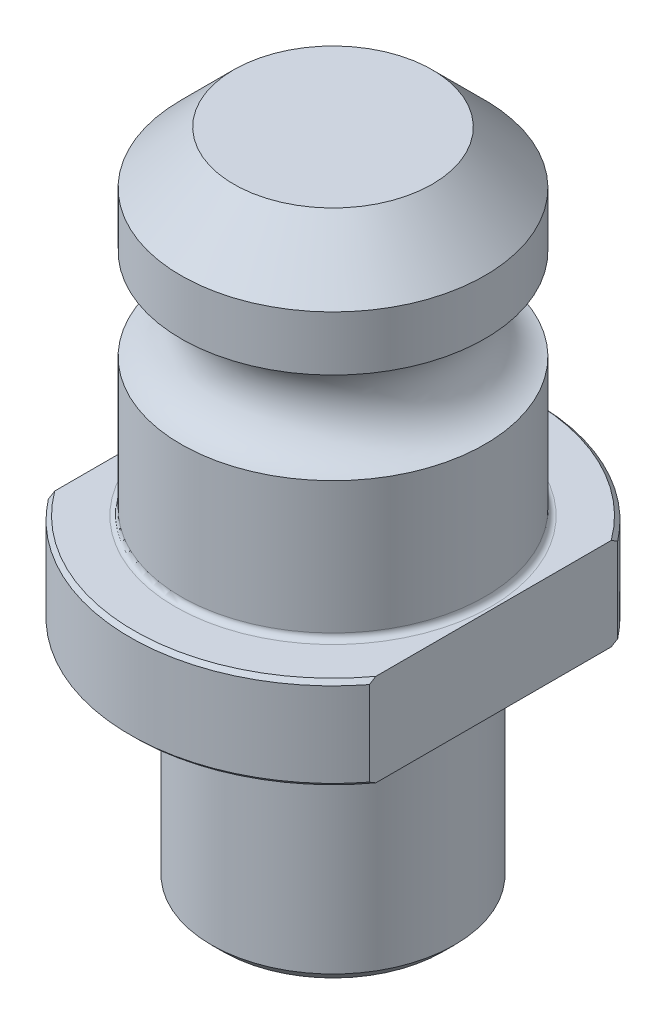
ISO-10303-21;
HEADER;
FILE_DESCRIPTION(('STEP AP214'),'2;1');
FILE_NAME('part.step','',(''),(''),'','','');
FILE_SCHEMA(('AUTOMOTIVE_DESIGN { 1 0 10303 214 1 1 1 1 }'));
ENDSEC;
DATA;
#1=APPLICATION_CONTEXT('core data for automotive mechanical design processes');
#2=APPLICATION_PROTOCOL_DEFINITION('international standard','automotive_design',2000,#1);
#3=PRODUCT_CONTEXT('',#1,'mechanical');
#4=PRODUCT('Part','Part','',(#3));
#5=PRODUCT_RELATED_PRODUCT_CATEGORY('part','',(#4));
#6=PRODUCT_DEFINITION_FORMATION('','',#4);
#7=PRODUCT_DEFINITION_CONTEXT('part definition',#1,'design');
#8=PRODUCT_DEFINITION('design','',#6,#7);
#9=PRODUCT_DEFINITION_SHAPE('','',#8);
#10=(LENGTH_UNIT() NAMED_UNIT(*) SI_UNIT(.MILLI.,.METRE.));
#11=(NAMED_UNIT(*) PLANE_ANGLE_UNIT() SI_UNIT($,.RADIAN.));
#12=(NAMED_UNIT(*) SI_UNIT($,.STERADIAN.) SOLID_ANGLE_UNIT());
#13=UNCERTAINTY_MEASURE_WITH_UNIT(LENGTH_MEASURE(1.E-05),#10,'distance_accuracy_value','');
#14=(GEOMETRIC_REPRESENTATION_CONTEXT(3) GLOBAL_UNCERTAINTY_ASSIGNED_CONTEXT((#13)) GLOBAL_UNIT_ASSIGNED_CONTEXT((#10,
#11,#12)) REPRESENTATION_CONTEXT('',''));
#15=CARTESIAN_POINT('',(0.,0.,0.));
#16=DIRECTION('',(0.,0.,1.));
#17=DIRECTION('',(1.,0.,0.));
#18=AXIS2_PLACEMENT_3D('',#15,#16,#17);
#19=CARTESIAN_POINT('',(0.,-30.0736,0.));
#20=DIRECTION('',(0.,1.,0.));
#21=DIRECTION('',(-1.,0.,0.));
#22=AXIS2_PLACEMENT_3D('',#19,#20,#21);
#23=CYLINDRICAL_SURFACE('',#22,26.4922);
#24=DIRECTION('',(0.,1.,0.));
#25=VECTOR('',#24,1.);
#26=CARTESIAN_POINT('',(-20.955,-30.0736,-16.2087826760679));
#27=LINE('',#26,#25);
#28=CARTESIAN_POINT('',(-20.955,0.507999999999984,-16.2087826760679));
#29=VERTEX_POINT('',#28);
#30=CARTESIAN_POINT('',(-20.955,11.5316,-16.2087826760679));
#31=VERTEX_POINT('',#30);
#32=EDGE_CURVE('E178',#29,#31,#27,.T.);
#33=ORIENTED_EDGE('',*,*,#32,.T.);
#34=CARTESIAN_POINT('',(0.,11.5316,0.));
#35=DIRECTION('',(0.,1.,0.));
#36=DIRECTION('',(-1.,0.,0.));
#37=AXIS2_PLACEMENT_3D('',#34,#35,#36);
#38=CIRCLE('',#37,26.4922);
#39=CARTESIAN_POINT('',(20.955,11.5316,-16.2087826760679));
#40=VERTEX_POINT('',#39);
#41=EDGE_CURVE('E196',#31,#40,#38,.F.);
#42=ORIENTED_EDGE('',*,*,#41,.T.);
#43=DIRECTION('',(0.,1.,0.));
#44=VECTOR('',#43,1.);
#45=CARTESIAN_POINT('',(20.955,-30.0736,-16.2087826760679));
#46=LINE('',#45,#44);
#47=CARTESIAN_POINT('',(20.955,0.507999999999986,-16.2087826760679));
#48=VERTEX_POINT('',#47);
#49=EDGE_CURVE('E158',#48,#40,#46,.T.);
#50=ORIENTED_EDGE('',*,*,#49,.F.);
#51=CARTESIAN_POINT('',(0.,0.507999999999984,0.));
#52=DIRECTION('',(0.,-1.,0.));
#53=DIRECTION('',(1.,0.,0.));
#54=AXIS2_PLACEMENT_3D('',#51,#52,#53);
#55=CIRCLE('',#54,26.4922);
#56=EDGE_CURVE('E199',#48,#29,#55,.F.);
#57=ORIENTED_EDGE('',*,*,#56,.T.);
#58=EDGE_LOOP('',(#33,#42,#50,#57));
#59=FACE_BOUND('',#58,.T.);
#60=ADVANCED_FACE('F31',(#59),#23,.T.);
#61=CARTESIAN_POINT('',(0.,0.507999999999984,0.));
#62=DIRECTION('',(0.,1.,0.));
#63=DIRECTION('',(-1.,0.,0.));
#64=AXIS2_PLACEMENT_3D('',#61,#62,#63);
#65=CONICAL_SURFACE('',#64,26.4922,0.785398163397452);
#66=CARTESIAN_POINT('',(-20.955,15.3786316810791,-35.6619099275024));
#67=CARTESIAN_POINT('',(-20.955,14.9216793764967,-35.1318867491076));
#68=CARTESIAN_POINT('',(-20.955,14.4662030686278,-34.6005861469611));
#69=CARTESIAN_POINT('',(-20.955,13.5586344415844,-33.5350869427466));
#70=CARTESIAN_POINT('',(-20.955,13.1065421827849,-33.000888289266));
#71=CARTESIAN_POINT('',(-20.955,12.205968591938,-31.9290052120931));
#72=CARTESIAN_POINT('',(-20.955,11.7574891447149,-31.3913192035786));
#73=CARTESIAN_POINT('',(-20.955,10.8649120638348,-30.312323516559));
#74=CARTESIAN_POINT('',(-20.955,10.4208144137888,-29.7710138516202));
#75=CARTESIAN_POINT('',(-20.955,9.52668821952122,-28.6708291561023));
#76=CARTESIAN_POINT('',(-20.955,9.07678583859596,-28.1118514959616));
#77=CARTESIAN_POINT('',(-20.955,8.18309722765685,-26.989029407178));
#78=CARTESIAN_POINT('',(-20.955,7.73931095538071,-26.425185012208));
#79=CARTESIAN_POINT('',(-20.955,6.85897582814535,-25.2920818271233));
#80=CARTESIAN_POINT('',(-20.955,6.42242528048358,-24.7228243538003));
#81=CARTESIAN_POINT('',(-20.955,5.55770659738342,-23.5779689040285));
#82=CARTESIAN_POINT('',(-20.955,5.12953845536948,-23.002370932554));
#83=CARTESIAN_POINT('',(-20.955,4.28247126091997,-21.842992233023));
#84=CARTESIAN_POINT('',(-20.955,3.86358783515081,-21.2592000655374));
#85=CARTESIAN_POINT('',(-20.955,3.03773164306435,-20.083220901885));
#86=CARTESIAN_POINT('',(-20.955,2.63075901321588,-19.4910338096481));
#87=CARTESIAN_POINT('',(-20.955,1.83083466168243,-18.2964784979267));
#88=CARTESIAN_POINT('',(-20.955,1.43789562453277,-17.6941017584344));
#89=CARTESIAN_POINT('',(-20.955,0.669551593220243,-16.4782430882497));
#90=CARTESIAN_POINT('',(-20.955,0.294146217763032,-15.8647613994531));
#91=CARTESIAN_POINT('',(-20.955,-0.432002865836843,-14.630437277539));
#92=CARTESIAN_POINT('',(-20.955,-0.782931639839121,-14.0097042501795));
#93=CARTESIAN_POINT('',(-20.955,-1.45875294781339,-12.7540422315145));
#94=CARTESIAN_POINT('',(-20.955,-1.78364236607461,-12.119111552995));
#95=CARTESIAN_POINT('',(-20.955,-2.40065204497457,-10.8345950751049));
#96=CARTESIAN_POINT('',(-20.955,-2.69282213181895,-10.1850334195645));
#97=CARTESIAN_POINT('',(-20.955,-3.23726727986781,-8.86957079794427));
#98=CARTESIAN_POINT('',(-20.955,-3.48955812101578,-8.20367641570651));
#99=CARTESIAN_POINT('',(-20.955,-3.95119671298151,-6.83837448786304));
#100=CARTESIAN_POINT('',(-20.955,-4.15932452663909,-6.13854536942428));
#101=CARTESIAN_POINT('',(-20.955,-4.42557667150594,-5.0773677597743));
#102=CARTESIAN_POINT('',(-20.955,-4.50667587473933,-4.72170462236656));
#103=CARTESIAN_POINT('',(-20.955,-4.65239096179193,-4.00703560322836));
#104=CARTESIAN_POINT('',(-20.955,-4.71700914684199,-3.64803019544004));
#105=CARTESIAN_POINT('',(-20.955,-4.82842178039746,-2.92921911832924));
#106=CARTESIAN_POINT('',(-20.955,-4.87530955594894,-2.56942795720181));
#107=CARTESIAN_POINT('',(-20.955,-4.95093580213762,-1.84793526800252));
#108=CARTESIAN_POINT('',(-20.955,-4.97967443767978,-1.4862337573184));
#109=CARTESIAN_POINT('',(-20.955,-5.01847483744489,-0.761842291258823));
#110=CARTESIAN_POINT('',(-20.955,-5.02853747477161,-0.399152382884933));
#111=CARTESIAN_POINT('',(-20.955,-5.02979913742401,0.326260889713069));
#112=CARTESIAN_POINT('',(-20.955,-5.02099813763078,0.688984253981089));
#113=CARTESIAN_POINT('',(-20.955,-4.98470198526908,1.41341460895418));
#114=CARTESIAN_POINT('',(-20.955,-4.95721069837262,1.77512179430263));
#115=CARTESIAN_POINT('',(-20.955,-4.8840435620658,2.49668205915928));
#116=CARTESIAN_POINT('',(-20.955,-4.83836765499246,2.85653513278446));
#117=CARTESIAN_POINT('',(-20.955,-4.72962027558933,3.57361600608002));
#118=CARTESIAN_POINT('',(-20.955,-4.66654788547041,3.93084366621991));
#119=CARTESIAN_POINT('',(-20.955,-4.52402701562188,4.64203334338745));
#120=CARTESIAN_POINT('',(-20.955,-4.44457605407092,4.99599485699835));
#121=CARTESIAN_POINT('',(-20.955,-4.18224544344754,6.05675532692679));
#122=CARTESIAN_POINT('',(-20.955,-3.97609658034429,6.75791934744646));
#123=CARTESIAN_POINT('',(-20.955,-3.62827640165839,7.79627618391861));
#124=CARTESIAN_POINT('',(-20.955,-3.50589488562347,8.14018416623479));
#125=CARTESIAN_POINT('',(-20.955,-3.24945534638195,8.82365293862814));
#126=CARTESIAN_POINT('',(-20.955,-3.11539705650793,9.16321362922113));
#127=CARTESIAN_POINT('',(-20.955,-2.79928394879735,9.92876903399494));
#128=CARTESIAN_POINT('',(-20.955,-2.61402065033465,10.3534355980843));
#129=CARTESIAN_POINT('',(-20.955,-2.22872511055782,11.1960235010303));
#130=CARTESIAN_POINT('',(-20.955,-2.02869178517524,11.6139443420257));
#131=CARTESIAN_POINT('',(-20.955,-1.61566843118649,12.4435850656605));
#132=CARTESIAN_POINT('',(-20.955,-1.40267173067073,12.8553016167744));
#133=CARTESIAN_POINT('',(-20.955,-0.965488560966872,13.6727152546063));
#134=CARTESIAN_POINT('',(-20.955,-0.741302473239506,14.0784125459179));
#135=CARTESIAN_POINT('',(-20.955,-0.28269064512495,14.8850902307436));
#136=CARTESIAN_POINT('',(-20.955,-0.0482444524277921,15.2860589726437));
#137=CARTESIAN_POINT('',(-20.955,0.429222390556218,16.082863076133));
#138=CARTESIAN_POINT('',(-20.955,0.672243339674915,16.478698258158));
#139=CARTESIAN_POINT('',(-20.955,1.41240613564717,17.6589447676084));
#140=CARTESIAN_POINT('',(-20.955,1.92077842067232,18.4363238664039));
#141=CARTESIAN_POINT('',(-20.955,2.96328687809537,19.9792291602264));
#142=CARTESIAN_POINT('',(-20.955,3.49754043758378,20.7446754395278));
#143=CARTESIAN_POINT('',(-20.955,4.58448890471796,22.2623700786226));
#144=CARTESIAN_POINT('',(-20.955,5.13718455391019,23.0146179058533));
#145=CARTESIAN_POINT('',(-20.955,6.25663004461089,24.5071890832017));
#146=CARTESIAN_POINT('',(-20.955,6.82336288867572,25.2475252208699));
#147=CARTESIAN_POINT('',(-20.955,7.96869622565411,26.718913960253));
#148=CARTESIAN_POINT('',(-20.955,8.54729643992717,27.449966779285));
#149=CARTESIAN_POINT('',(-20.955,9.64159884476376,28.8137066048225));
#150=CARTESIAN_POINT('',(-20.955,10.1561632277905,29.4473084849898));
#151=CARTESIAN_POINT('',(-20.955,11.1917248024465,30.7094034474824));
#152=CARTESIAN_POINT('',(-20.955,11.7127230358346,31.3378956743989));
#153=CARTESIAN_POINT('',(-20.955,12.7553253783335,32.5845773164151));
#154=CARTESIAN_POINT('',(-20.955,13.2768798144798,33.2028083216013));
#155=CARTESIAN_POINT('',(-20.955,14.3245141746313,34.4352284310873));
#156=CARTESIAN_POINT('',(-20.955,14.8505932435754,35.0494182619761));
#157=CARTESIAN_POINT('',(-20.955,15.3786316810791,35.6619099275024));
#158=B_SPLINE_CURVE_WITH_KNOTS('',3,(#66,#67,#68,#69,#70,#71,#72,#73,#74,#75,#76,#77,#78,#79,
#80,#81,#82,#83,#84,#85,#86,#87,#88,#89,#90,#91,#92,#93,#94,#95,#96,#97,#98,#99,#100,#101,#102,
#103,#104,#105,#106,#107,#108,#109,#110,#111,#112,#113,#114,#115,#116,#117,#118,#119,#120,#121,
#122,#123,#124,#125,#126,#127,#128,#129,#130,#131,#132,#133,#134,#135,#136,#137,#138,#139,#140,
#141,#142,#143,#144,#145,#146,#147,#148,#149,#150,#151,#152,#153,#154,#155,#156,#157),
.UNSPECIFIED.,.F.,.F.,(4,2,2,2,2,2,2,2,2,2,2,2,2,2,2,2,2,2,2,2,2,2,2,2,2,2,2,2,2,2,2,2,2,2,2,2,
2,2,2,2,2,2,2,2,2,4),(0.,2.09942410165156,4.19888557039205,6.29937935967337,8.39986528957602,
10.552457837884,12.7050355043173,14.8571022863838,17.0091673801996,19.1646150287776,
21.3200873638983,23.4774610450651,25.6347877892161,27.7734736972529,29.9124151265691,
32.0480536840951,34.1828450571805,36.3705707704272,37.4646250503705,38.5585264846929,
39.6465870651191,40.7346377591721,41.8226375855233,42.9106388606607,43.9984151752578,
45.0861949391944,46.1740321022885,47.2620342251061,49.4516892833064,50.5466504012234,
51.6416365317908,53.0312643633345,54.4209942902935,55.8114456246282,57.2018495890064,
58.5951640870748,59.9885271904642,62.7744689635165,65.5745127339502,68.3746692286286,
71.1715865124565,73.9684382009378,76.4170762202526,78.8661160578072,81.2926243402521,
83.7186837210244),.UNSPECIFIED.);
#159=CARTESIAN_POINT('',(-20.955,0.,-15.364459790048));
#160=VERTEX_POINT('',#159);
#161=EDGE_CURVE('E179',#29,#160,#158,.T.);
#162=ORIENTED_EDGE('',*,*,#161,.F.);
#163=ORIENTED_EDGE('',*,*,#56,.F.);
#164=CARTESIAN_POINT('',(20.955,15.3786316810791,35.6619099275024));
#165=CARTESIAN_POINT('',(20.955,14.9216793764967,35.1318867491076));
#166=CARTESIAN_POINT('',(20.955,14.4662030686279,34.6005861469611));
#167=CARTESIAN_POINT('',(20.955,13.5586344415845,33.5350869427466));
#168=CARTESIAN_POINT('',(20.955,13.1065421827849,33.000888289266));
#169=CARTESIAN_POINT('',(20.955,12.205968591938,31.9290052120931));
#170=CARTESIAN_POINT('',(20.955,11.7574891447149,31.3913192035786));
#171=CARTESIAN_POINT('',(20.955,10.8649120638348,30.312323516559));
#172=CARTESIAN_POINT('',(20.955,10.4208144137888,29.7710138516202));
#173=CARTESIAN_POINT('',(20.955,9.52668821952123,28.6708291561023));
#174=CARTESIAN_POINT('',(20.955,9.07678583859597,28.1118514959616));
#175=CARTESIAN_POINT('',(20.955,8.18309722765686,26.989029407178));
#176=CARTESIAN_POINT('',(20.955,7.73931095538071,26.425185012208));
#177=CARTESIAN_POINT('',(20.955,6.85897582814535,25.2920818271233));
#178=CARTESIAN_POINT('',(20.955,6.42242528048358,24.7228243538003));
#179=CARTESIAN_POINT('',(20.955,5.55770659738343,23.5779689040285));
#180=CARTESIAN_POINT('',(20.955,5.12953845536949,23.002370932554));
#181=CARTESIAN_POINT('',(20.955,4.28247126091998,21.842992233023));
#182=CARTESIAN_POINT('',(20.955,3.86358783515082,21.2592000655374));
#183=CARTESIAN_POINT('',(20.955,3.03773164306436,20.0832209018851));
#184=CARTESIAN_POINT('',(20.955,2.63075901321589,19.4910338096481));
#185=CARTESIAN_POINT('',(20.955,1.83083466168244,18.2964784979267));
#186=CARTESIAN_POINT('',(20.955,1.43789562453277,17.6941017584344));
#187=CARTESIAN_POINT('',(20.955,0.669551593220245,16.4782430882497));
#188=CARTESIAN_POINT('',(20.955,0.294146217763037,15.8647613994531));
#189=CARTESIAN_POINT('',(20.955,-0.432002865836835,14.630437277539));
#190=CARTESIAN_POINT('',(20.955,-0.782931639839114,14.0097042501795));
#191=CARTESIAN_POINT('',(20.955,-1.45875294781339,12.7540422315145));
#192=CARTESIAN_POINT('',(20.955,-1.78364236607461,12.119111552995));
#193=CARTESIAN_POINT('',(20.955,-2.40065204497457,10.8345950751049));
#194=CARTESIAN_POINT('',(20.955,-2.69282213181894,10.1850334195645));
#195=CARTESIAN_POINT('',(20.955,-3.23726727986781,8.86957079794428));
#196=CARTESIAN_POINT('',(20.955,-3.48955812101578,8.20367641570652));
#197=CARTESIAN_POINT('',(20.955,-3.95119671298151,6.83837448786304));
#198=CARTESIAN_POINT('',(20.955,-4.15932452663908,6.13854536942429));
#199=CARTESIAN_POINT('',(20.955,-4.42557667150594,5.0773677597743));
#200=CARTESIAN_POINT('',(20.955,-4.50667587473933,4.72170462236656));
#201=CARTESIAN_POINT('',(20.955,-4.65239096179193,4.00703560322836));
#202=CARTESIAN_POINT('',(20.955,-4.71700914684199,3.64803019544004));
#203=CARTESIAN_POINT('',(20.955,-4.82842178039746,2.92921911832924));
#204=CARTESIAN_POINT('',(20.955,-4.87530955594894,2.56942795720182));
#205=CARTESIAN_POINT('',(20.955,-4.95093580213762,1.84793526800253));
#206=CARTESIAN_POINT('',(20.955,-4.97967443767978,1.4862337573184));
#207=CARTESIAN_POINT('',(20.955,-5.01847483744489,0.761842291258827));
#208=CARTESIAN_POINT('',(20.955,-5.02853747477162,0.399152382884936));
#209=CARTESIAN_POINT('',(20.955,-5.02979913742401,-0.326260889713066));
#210=CARTESIAN_POINT('',(20.955,-5.02099813763078,-0.688984253981084));
#211=CARTESIAN_POINT('',(20.955,-4.98470198526908,-1.41341460895417));
#212=CARTESIAN_POINT('',(20.955,-4.95721069837262,-1.77512179430262));
#213=CARTESIAN_POINT('',(20.955,-4.8840435620658,-2.49668205915927));
#214=CARTESIAN_POINT('',(20.955,-4.83836765499246,-2.85653513278446));
#215=CARTESIAN_POINT('',(20.955,-4.72962027558933,-3.57361600608002));
#216=CARTESIAN_POINT('',(20.955,-4.66654788547041,-3.93084366621991));
#217=CARTESIAN_POINT('',(20.955,-4.52402701562188,-4.64203334338745));
#218=CARTESIAN_POINT('',(20.955,-4.44457605407092,-4.99599485699834));
#219=CARTESIAN_POINT('',(20.955,-4.18224544344754,-6.05675532692679));
#220=CARTESIAN_POINT('',(20.955,-3.97609658034429,-6.75791934744645));
#221=CARTESIAN_POINT('',(20.955,-3.62827640165839,-7.7962761839186));
#222=CARTESIAN_POINT('',(20.955,-3.50589488562347,-8.14018416623478));
#223=CARTESIAN_POINT('',(20.955,-3.24945534638195,-8.82365293862813));
#224=CARTESIAN_POINT('',(20.955,-3.11539705650794,-9.16321362922112));
#225=CARTESIAN_POINT('',(20.955,-2.79928394879736,-9.92876903399493));
#226=CARTESIAN_POINT('',(20.955,-2.61402065033465,-10.3534355980843));
#227=CARTESIAN_POINT('',(20.955,-2.22872511055782,-11.1960235010303));
#228=CARTESIAN_POINT('',(20.955,-2.02869178517524,-11.6139443420257));
#229=CARTESIAN_POINT('',(20.955,-1.61566843118649,-12.4435850656605));
#230=CARTESIAN_POINT('',(20.955,-1.40267173067073,-12.8553016167744));
#231=CARTESIAN_POINT('',(20.955,-0.965488560966878,-13.6727152546063));
#232=CARTESIAN_POINT('',(20.955,-0.741302473239514,-14.0784125459179));
#233=CARTESIAN_POINT('',(20.955,-0.28269064512496,-14.8850902307436));
#234=CARTESIAN_POINT('',(20.955,-0.0482444524278021,-15.2860589726437));
#235=CARTESIAN_POINT('',(20.955,0.429222390556209,-16.082863076133));
#236=CARTESIAN_POINT('',(20.955,0.672243339674907,-16.478698258158));
#237=CARTESIAN_POINT('',(20.955,1.41240613564717,-17.6589447676083));
#238=CARTESIAN_POINT('',(20.955,1.92077842067231,-18.4363238664039));
#239=CARTESIAN_POINT('',(20.955,2.96328687809537,-19.9792291602264));
#240=CARTESIAN_POINT('',(20.955,3.49754043758378,-20.7446754395278));
#241=CARTESIAN_POINT('',(20.955,4.58448890471795,-22.2623700786226));
#242=CARTESIAN_POINT('',(20.955,5.13718455391018,-23.0146179058533));
#243=CARTESIAN_POINT('',(20.955,6.25663004461087,-24.5071890832017));
#244=CARTESIAN_POINT('',(20.955,6.82336288867571,-25.2475252208699));
#245=CARTESIAN_POINT('',(20.955,7.9686962256541,-26.718913960253));
#246=CARTESIAN_POINT('',(20.955,8.54729643992717,-27.4499667792849));
#247=CARTESIAN_POINT('',(20.955,9.64159884476376,-28.8137066048225));
#248=CARTESIAN_POINT('',(20.955,10.1561632277905,-29.4473084849898));
#249=CARTESIAN_POINT('',(20.955,11.1917248024465,-30.7094034474824));
#250=CARTESIAN_POINT('',(20.955,11.7127230358346,-31.3378956743989));
#251=CARTESIAN_POINT('',(20.955,12.7553253783335,-32.5845773164152));
#252=CARTESIAN_POINT('',(20.955,13.2768798144798,-33.2028083216013));
#253=CARTESIAN_POINT('',(20.955,14.3245141746313,-34.4352284310873));
#254=CARTESIAN_POINT('',(20.955,14.8505932435755,-35.0494182619761));
#255=CARTESIAN_POINT('',(20.955,15.3786316810791,-35.6619099275024));
#256=B_SPLINE_CURVE_WITH_KNOTS('',3,(#164,#165,#166,#167,#168,#169,#170,#171,#172,#173,#174,
#175,#176,#177,#178,#179,#180,#181,#182,#183,#184,#185,#186,#187,#188,#189,#190,#191,#192,#193,
#194,#195,#196,#197,#198,#199,#200,#201,#202,#203,#204,#205,#206,#207,#208,#209,#210,#211,#212,
#213,#214,#215,#216,#217,#218,#219,#220,#221,#222,#223,#224,#225,#226,#227,#228,#229,#230,#231,
#232,#233,#234,#235,#236,#237,#238,#239,#240,#241,#242,#243,#244,#245,#246,#247,#248,#249,#250,
#251,#252,#253,#254,#255),.UNSPECIFIED.,.F.,.F.,(4,2,2,2,2,2,2,2,2,2,2,2,2,2,2,2,2,2,2,2,2,2,2,
2,2,2,2,2,2,2,2,2,2,2,2,2,2,2,2,2,2,2,2,2,2,4),(0.,2.09942410165156,4.19888557039205,
6.29937935967337,8.39986528957602,10.552457837884,12.7050355043173,14.8571022863838,
17.0091673801996,19.1646150287776,21.3200873638983,23.4774610450651,25.6347877892161,
27.7734736972528,29.9124151265691,32.0480536840952,34.1828450571805,36.3705707704272,
37.4646250503705,38.5585264846929,39.6465870651191,40.7346377591721,41.8226375855233,
42.9106388606607,43.9984151752578,45.0861949391944,46.1740321022885,47.2620342251061,
49.4516892833064,50.5466504012234,51.6416365317908,53.0312643633345,54.4209942902935,
55.8114456246282,57.2018495890064,58.5951640870748,59.9885271904642,62.7744689635165,
65.5745127339502,68.3746692286286,71.1715865124565,73.9684382009378,76.4170762202526,
78.8661160578072,81.2926243402521,83.7186837210244),.UNSPECIFIED.);
#257=CARTESIAN_POINT('',(20.955,0.,-15.364459790048));
#258=VERTEX_POINT('',#257);
#259=EDGE_CURVE('E149',#258,#48,#256,.T.);
#260=ORIENTED_EDGE('',*,*,#259,.F.);
#261=CARTESIAN_POINT('',(0.,0.,0.));
#262=DIRECTION('',(0.,-1.,0.));
#263=DIRECTION('',(1.,0.,0.));
#264=AXIS2_PLACEMENT_3D('',#261,#262,#263);
#265=CIRCLE('',#264,25.9842);
#266=EDGE_CURVE('E116',#160,#258,#265,.T.);
#267=ORIENTED_EDGE('',*,*,#266,.F.);
#268=EDGE_LOOP('',(#162,#163,#260,#267));
#269=FACE_BOUND('',#268,.T.);
#270=ADVANCED_FACE('F166',(#269),#65,.T.);
#271=CARTESIAN_POINT('',(0.,12.0396,0.));
#272=DIRECTION('',(0.,-1.,0.));
#273=DIRECTION('',(1.,0.,0.));
#274=AXIS2_PLACEMENT_3D('',#271,#272,#273);
#275=CONICAL_SURFACE('',#274,25.9842,0.785398163397458);
#276=CARTESIAN_POINT('',(-20.955,-3.33903168107893,35.6619099275024));
#277=CARTESIAN_POINT('',(-20.955,-2.88207937649652,35.1318867491075));
#278=CARTESIAN_POINT('',(-20.955,-2.42660306862767,34.6005861469611));
#279=CARTESIAN_POINT('',(-20.955,-1.51903444158429,33.5350869427466));
#280=CARTESIAN_POINT('',(-20.955,-1.06694218278475,33.000888289266));
#281=CARTESIAN_POINT('',(-20.955,-0.166368591937883,31.9290052120931));
#282=CARTESIAN_POINT('',(-20.955,0.282110855285301,31.3913192035786));
#283=CARTESIAN_POINT('',(-20.955,1.1746879361654,30.312323516559));
#284=CARTESIAN_POINT('',(-20.955,1.61878558621138,29.7710138516201));
#285=CARTESIAN_POINT('',(-20.955,2.51291178047892,28.6708291561022));
#286=CARTESIAN_POINT('',(-20.955,2.96281416140418,28.1118514959615));
#287=CARTESIAN_POINT('',(-20.955,3.85650277234328,26.9890294071779));
#288=CARTESIAN_POINT('',(-20.955,4.30028904461943,26.425185012208));
#289=CARTESIAN_POINT('',(-20.955,5.18062417185479,25.2920818271232));
#290=CARTESIAN_POINT('',(-20.955,5.61717471951655,24.7228243538002));
#291=CARTESIAN_POINT('',(-20.955,6.4818934026167,23.5779689040283));
#292=CARTESIAN_POINT('',(-20.955,6.91006154463064,23.0023709325539));
#293=CARTESIAN_POINT('',(-20.955,7.75712873908015,21.8429922330229));
#294=CARTESIAN_POINT('',(-20.955,8.1760121648493,21.2592000655373));
#295=CARTESIAN_POINT('',(-20.955,9.00186835693576,20.0832209018849));
#296=CARTESIAN_POINT('',(-20.955,9.40884098678422,19.491033809648));
#297=CARTESIAN_POINT('',(-20.955,10.2087653383177,18.2964784979266));
#298=CARTESIAN_POINT('',(-20.955,10.6017043754673,17.6941017584342));
#299=CARTESIAN_POINT('',(-20.955,11.3700484067798,16.4782430882495));
#300=CARTESIAN_POINT('',(-20.955,11.7454537822371,15.8647613994529));
#301=CARTESIAN_POINT('',(-20.955,12.4716028658369,14.6304372775388));
#302=CARTESIAN_POINT('',(-20.955,12.8225316398392,14.0097042501793));
#303=CARTESIAN_POINT('',(-20.955,13.4983529478135,12.7540422315142));
#304=CARTESIAN_POINT('',(-20.955,13.8232423660747,12.1191115529948));
#305=CARTESIAN_POINT('',(-20.955,14.4402520449746,10.8345950751046));
#306=CARTESIAN_POINT('',(-20.955,14.732422131819,10.1850334195643));
#307=CARTESIAN_POINT('',(-20.955,15.2768672798678,8.86957079794401));
#308=CARTESIAN_POINT('',(-20.955,15.5291581210158,8.20367641570625));
#309=CARTESIAN_POINT('',(-20.955,15.9907967129815,6.83837448786276));
#310=CARTESIAN_POINT('',(-20.955,16.1989245266391,6.138545369424));
#311=CARTESIAN_POINT('',(-20.955,16.4651766715059,5.07736775977401));
#312=CARTESIAN_POINT('',(-20.955,16.5462758747393,4.72170462236627));
#313=CARTESIAN_POINT('',(-20.955,16.6919909617919,4.00703560322806));
#314=CARTESIAN_POINT('',(-20.955,16.7566091468419,3.64803019543974));
#315=CARTESIAN_POINT('',(-20.955,16.8680217803974,2.92921911832892));
#316=CARTESIAN_POINT('',(-20.955,16.9149095559489,2.5694279572015));
#317=CARTESIAN_POINT('',(-20.955,16.9905358021375,1.8479352680022));
#318=CARTESIAN_POINT('',(-20.955,17.0192744376797,1.48623375731808));
#319=CARTESIAN_POINT('',(-20.955,17.0580748374448,0.761842291258494));
#320=CARTESIAN_POINT('',(-20.955,17.0681374747715,0.399152382884598));
#321=CARTESIAN_POINT('',(-20.955,17.0693991374239,-0.326260889713413));
#322=CARTESIAN_POINT('',(-20.955,17.0605981376307,-0.688984253981435));
#323=CARTESIAN_POINT('',(-20.955,17.0243019852689,-1.41341460895453));
#324=CARTESIAN_POINT('',(-20.955,16.9968106983725,-1.77512179430298));
#325=CARTESIAN_POINT('',(-20.955,16.9236435620657,-2.49668205915963));
#326=CARTESIAN_POINT('',(-20.955,16.8779676549923,-2.85653513278482));
#327=CARTESIAN_POINT('',(-20.955,16.7692202755892,-3.57361600608038));
#328=CARTESIAN_POINT('',(-20.955,16.7061478854702,-3.93084366622027));
#329=CARTESIAN_POINT('',(-20.955,16.5636270156217,-4.64203334338781));
#330=CARTESIAN_POINT('',(-20.955,16.4841760540707,-4.99599485699871));
#331=CARTESIAN_POINT('',(-20.955,16.2218454434473,-6.05675532692715));
#332=CARTESIAN_POINT('',(-20.955,16.0156965803441,-6.75791934744682));
#333=CARTESIAN_POINT('',(-20.955,15.6678764016582,-7.79627618391898));
#334=CARTESIAN_POINT('',(-20.955,15.5454948856232,-8.14018416623516));
#335=CARTESIAN_POINT('',(-20.955,15.2890553463817,-8.82365293862851));
#336=CARTESIAN_POINT('',(-20.955,15.1549970565077,-9.1632136292215));
#337=CARTESIAN_POINT('',(-20.955,14.8388839487971,-9.92876903399534));
#338=CARTESIAN_POINT('',(-20.955,14.6536206503344,-10.3534355980847));
#339=CARTESIAN_POINT('',(-20.955,14.2683251105575,-11.1960235010308));
#340=CARTESIAN_POINT('',(-20.955,14.0682917851749,-11.6139443420262));
#341=CARTESIAN_POINT('',(-20.955,13.6552684311861,-12.4435850656611));
#342=CARTESIAN_POINT('',(-20.955,13.4422717306704,-12.855301616775));
#343=CARTESIAN_POINT('',(-20.955,13.0050885609665,-13.672715254607));
#344=CARTESIAN_POINT('',(-20.955,12.7809024732391,-14.0784125459186));
#345=CARTESIAN_POINT('',(-20.955,12.3222906451245,-14.8850902307443));
#346=CARTESIAN_POINT('',(-20.955,12.0878444524273,-15.2860589726444));
#347=CARTESIAN_POINT('',(-20.955,11.6103776094433,-16.0828630761338));
#348=CARTESIAN_POINT('',(-20.955,11.3673566603246,-16.4786982581588));
#349=CARTESIAN_POINT('',(-20.955,10.6271938643522,-17.6589447676092));
#350=CARTESIAN_POINT('',(-20.955,10.1188215793271,-18.4363238664048));
#351=CARTESIAN_POINT('',(-20.955,9.07631312190392,-19.9792291602274));
#352=CARTESIAN_POINT('',(-20.955,8.54205956241547,-20.7446754395289));
#353=CARTESIAN_POINT('',(-20.955,7.45511109528122,-22.2623700786238));
#354=CARTESIAN_POINT('',(-20.955,6.90241544608895,-23.0146179058545));
#355=CARTESIAN_POINT('',(-20.955,5.78296995538818,-24.507189083203));
#356=CARTESIAN_POINT('',(-20.955,5.2162371113233,-25.2475252208713));
#357=CARTESIAN_POINT('',(-20.955,4.07090377434483,-26.7189139602545));
#358=CARTESIAN_POINT('',(-20.955,3.49230356007172,-27.4499667792864));
#359=CARTESIAN_POINT('',(-20.955,2.3980011552352,-28.8137066048239));
#360=CARTESIAN_POINT('',(-20.955,1.88343677220854,-29.447308484991));
#361=CARTESIAN_POINT('',(-20.955,0.847875197552819,-30.7094034474834));
#362=CARTESIAN_POINT('',(-20.955,0.326876964164816,-31.3378956743998));
#363=CARTESIAN_POINT('',(-20.955,-0.715725378333843,-32.5845773164158));
#364=CARTESIAN_POINT('',(-20.955,-1.2372798144801,-33.2028083216018));
#365=CARTESIAN_POINT('',(-20.955,-2.2849141746313,-34.4352284310875));
#366=CARTESIAN_POINT('',(-20.955,-2.81099324357539,-35.0494182619762));
#367=CARTESIAN_POINT('',(-20.955,-3.33903168107894,-35.6619099275024));
#368=B_SPLINE_CURVE_WITH_KNOTS('',3,(#276,#277,#278,#279,#280,#281,#282,#283,#284,#285,#286,
#287,#288,#289,#290,#291,#292,#293,#294,#295,#296,#297,#298,#299,#300,#301,#302,#303,#304,#305,
#306,#307,#308,#309,#310,#311,#312,#313,#314,#315,#316,#317,#318,#319,#320,#321,#322,#323,#324,
#325,#326,#327,#328,#329,#330,#331,#332,#333,#334,#335,#336,#337,#338,#339,#340,#341,#342,#343,
#344,#345,#346,#347,#348,#349,#350,#351,#352,#353,#354,#355,#356,#357,#358,#359,#360,#361,#362,
#363,#364,#365,#366,#367),.UNSPECIFIED.,.F.,.F.,(4,2,2,2,2,2,2,2,2,2,2,2,2,2,2,2,2,2,2,2,2,2,2,
2,2,2,2,2,2,2,2,2,2,2,2,2,2,2,2,2,2,2,2,2,2,4),(0.,2.09942410165157,4.19888557039206,
6.29937935967338,8.39986528957605,10.5524578378841,12.7050355043174,14.8571022863838,
17.0091673801997,19.1646150287776,21.3200873638984,23.4774610450652,25.6347877892162,
27.773473697253,29.9124151265693,32.0480536840953,34.1828450571807,36.3705707704273,
37.4646250503706,38.558526484693,39.6465870651192,40.7346377591723,41.8226375855235,
42.9106388606609,43.998415175258,45.0861949391946,46.1740321022886,47.2620342251063,
49.4516892833066,50.5466504012236,51.641636531791,53.0312643633348,54.4209942902939,
55.8114456246287,57.201849589007,58.5951640870755,59.988527190465,62.7744689635174,
65.5745127339513,68.3746692286299,71.171586512458,73.9684382009395,76.4170762202538,
78.8661160578079,81.2926243402523,83.7186837210241),.UNSPECIFIED.);
#369=CARTESIAN_POINT('',(-20.955,11.5316,16.2087826760679));
#370=VERTEX_POINT('',#369);
#371=CARTESIAN_POINT('',(-20.955,12.0396,15.3644597900479));
#372=VERTEX_POINT('',#371);
#373=EDGE_CURVE('E95',#370,#372,#368,.T.);
#374=ORIENTED_EDGE('',*,*,#373,.F.);
#375=CARTESIAN_POINT('',(20.955,11.5316,16.2087826760679));
#376=VERTEX_POINT('',#375);
#377=EDGE_CURVE('E202',#376,#370,#38,.F.);
#378=ORIENTED_EDGE('',*,*,#377,.F.);
#379=CARTESIAN_POINT('',(20.955,-3.33903168107894,-35.6619099275024));
#380=CARTESIAN_POINT('',(20.955,-2.88207937649653,-35.1318867491076));
#381=CARTESIAN_POINT('',(20.955,-2.42660306862768,-34.6005861469611));
#382=CARTESIAN_POINT('',(20.955,-1.51903444158429,-33.5350869427466));
#383=CARTESIAN_POINT('',(20.955,-1.06694218278476,-33.000888289266));
#384=CARTESIAN_POINT('',(20.955,-0.166368591937885,-31.9290052120931));
#385=CARTESIAN_POINT('',(20.955,0.282110855285298,-31.3913192035786));
#386=CARTESIAN_POINT('',(20.955,1.17468793616539,-30.312323516559));
#387=CARTESIAN_POINT('',(20.955,1.61878558621137,-29.7710138516201));
#388=CARTESIAN_POINT('',(20.955,2.51291178047892,-28.6708291561022));
#389=CARTESIAN_POINT('',(20.955,2.96281416140418,-28.1118514959615));
#390=CARTESIAN_POINT('',(20.955,3.85650277234328,-26.9890294071779));
#391=CARTESIAN_POINT('',(20.955,4.30028904461943,-26.425185012208));
#392=CARTESIAN_POINT('',(20.955,5.18062417185479,-25.2920818271232));
#393=CARTESIAN_POINT('',(20.955,5.61717471951655,-24.7228243538002));
#394=CARTESIAN_POINT('',(20.955,6.4818934026167,-23.5779689040283));
#395=CARTESIAN_POINT('',(20.955,6.91006154463064,-23.0023709325539));
#396=CARTESIAN_POINT('',(20.955,7.75712873908015,-21.8429922330229));
#397=CARTESIAN_POINT('',(20.955,8.17601216484931,-21.2592000655373));
#398=CARTESIAN_POINT('',(20.955,9.00186835693576,-20.0832209018849));
#399=CARTESIAN_POINT('',(20.955,9.40884098678423,-19.491033809648));
#400=CARTESIAN_POINT('',(20.955,10.2087653383177,-18.2964784979266));
#401=CARTESIAN_POINT('',(20.955,10.6017043754673,-17.6941017584342));
#402=CARTESIAN_POINT('',(20.955,11.3700484067798,-16.4782430882495));
#403=CARTESIAN_POINT('',(20.955,11.7454537822371,-15.8647613994529));
#404=CARTESIAN_POINT('',(20.955,12.4716028658369,-14.6304372775388));
#405=CARTESIAN_POINT('',(20.955,12.8225316398392,-14.0097042501793));
#406=CARTESIAN_POINT('',(20.955,13.4983529478135,-12.7540422315142));
#407=CARTESIAN_POINT('',(20.955,13.8232423660747,-12.1191115529947));
#408=CARTESIAN_POINT('',(20.955,14.4402520449746,-10.8345950751046));
#409=CARTESIAN_POINT('',(20.955,14.732422131819,-10.1850334195643));
#410=CARTESIAN_POINT('',(20.955,15.2768672798678,-8.869570797944));
#411=CARTESIAN_POINT('',(20.955,15.5291581210158,-8.20367641570623));
#412=CARTESIAN_POINT('',(20.955,15.9907967129815,-6.83837448786275));
#413=CARTESIAN_POINT('',(20.955,16.1989245266391,-6.13854536942399));
#414=CARTESIAN_POINT('',(20.955,16.4651766715059,-5.07736775977399));
#415=CARTESIAN_POINT('',(20.955,16.5462758747393,-4.72170462236625));
#416=CARTESIAN_POINT('',(20.955,16.6919909617919,-4.00703560322804));
#417=CARTESIAN_POINT('',(20.955,16.7566091468419,-3.64803019543972));
#418=CARTESIAN_POINT('',(20.955,16.8680217803974,-2.92921911832891));
#419=CARTESIAN_POINT('',(20.955,16.9149095559489,-2.56942795720148));
#420=CARTESIAN_POINT('',(20.955,16.9905358021375,-1.84793526800219));
#421=CARTESIAN_POINT('',(20.955,17.0192744376797,-1.48623375731806));
#422=CARTESIAN_POINT('',(20.955,17.0580748374448,-0.76184229125848));
#423=CARTESIAN_POINT('',(20.955,17.0681374747715,-0.399152382884587));
#424=CARTESIAN_POINT('',(20.955,17.0693991374239,0.326260889713422));
#425=CARTESIAN_POINT('',(20.955,17.0605981376307,0.688984253981445));
#426=CARTESIAN_POINT('',(20.955,17.0243019852689,1.41341460895454));
#427=CARTESIAN_POINT('',(20.955,16.9968106983725,1.77512179430299));
#428=CARTESIAN_POINT('',(20.955,16.9236435620657,2.49668205915964));
#429=CARTESIAN_POINT('',(20.955,16.8779676549923,2.85653513278483));
#430=CARTESIAN_POINT('',(20.955,16.7692202755892,3.57361600608039));
#431=CARTESIAN_POINT('',(20.955,16.7061478854702,3.93084366622028));
#432=CARTESIAN_POINT('',(20.955,16.5636270156217,4.64203334338782));
#433=CARTESIAN_POINT('',(20.955,16.4841760540707,4.99599485699872));
#434=CARTESIAN_POINT('',(20.955,16.2218454434473,6.05675532692716));
#435=CARTESIAN_POINT('',(20.955,16.0156965803441,6.75791934744683));
#436=CARTESIAN_POINT('',(20.955,15.6678764016582,7.79627618391899));
#437=CARTESIAN_POINT('',(20.955,15.5454948856232,8.14018416623517));
#438=CARTESIAN_POINT('',(20.955,15.2890553463817,8.82365293862851));
#439=CARTESIAN_POINT('',(20.955,15.1549970565077,9.1632136292215));
#440=CARTESIAN_POINT('',(20.955,14.8388839487971,9.92876903399535));
#441=CARTESIAN_POINT('',(20.955,14.6536206503344,10.3534355980847));
#442=CARTESIAN_POINT('',(20.955,14.2683251105575,11.1960235010308));
#443=CARTESIAN_POINT('',(20.955,14.0682917851749,11.6139443420262));
#444=CARTESIAN_POINT('',(20.955,13.6552684311861,12.4435850656611));
#445=CARTESIAN_POINT('',(20.955,13.4422717306704,12.855301616775));
#446=CARTESIAN_POINT('',(20.955,13.0050885609665,13.672715254607));
#447=CARTESIAN_POINT('',(20.955,12.7809024732391,14.0784125459186));
#448=CARTESIAN_POINT('',(20.955,12.3222906451245,14.8850902307443));
#449=CARTESIAN_POINT('',(20.955,12.0878444524273,15.2860589726444));
#450=CARTESIAN_POINT('',(20.955,11.6103776094433,16.0828630761338));
#451=CARTESIAN_POINT('',(20.955,11.3673566603246,16.4786982581588));
#452=CARTESIAN_POINT('',(20.955,10.6271938643522,17.6589447676092));
#453=CARTESIAN_POINT('',(20.955,10.1188215793271,18.4363238664048));
#454=CARTESIAN_POINT('',(20.955,9.07631312190392,19.9792291602275));
#455=CARTESIAN_POINT('',(20.955,8.54205956241546,20.7446754395289));
#456=CARTESIAN_POINT('',(20.955,7.45511109528121,22.2623700786238));
#457=CARTESIAN_POINT('',(20.955,6.90241544608894,23.0146179058545));
#458=CARTESIAN_POINT('',(20.955,5.78296995538817,24.507189083203));
#459=CARTESIAN_POINT('',(20.955,5.21623711132329,25.2475252208713));
#460=CARTESIAN_POINT('',(20.955,4.07090377434482,26.7189139602545));
#461=CARTESIAN_POINT('',(20.955,3.49230356007171,27.4499667792865));
#462=CARTESIAN_POINT('',(20.955,2.39800115523518,28.8137066048239));
#463=CARTESIAN_POINT('',(20.955,1.88343677220852,29.4473084849911));
#464=CARTESIAN_POINT('',(20.955,0.847875197552803,30.7094034474834));
#465=CARTESIAN_POINT('',(20.955,0.326876964164798,31.3378956743998));
#466=CARTESIAN_POINT('',(20.955,-0.715725378333862,32.5845773164158));
#467=CARTESIAN_POINT('',(20.955,-1.23727981448012,33.2028083216018));
#468=CARTESIAN_POINT('',(20.955,-2.28491417463132,34.4352284310875));
#469=CARTESIAN_POINT('',(20.955,-2.8109932435754,35.0494182619762));
#470=CARTESIAN_POINT('',(20.955,-3.33903168107894,35.6619099275024));
#471=B_SPLINE_CURVE_WITH_KNOTS('',3,(#379,#380,#381,#382,#383,#384,#385,#386,#387,#388,#389,
#390,#391,#392,#393,#394,#395,#396,#397,#398,#399,#400,#401,#402,#403,#404,#405,#406,#407,#408,
#409,#410,#411,#412,#413,#414,#415,#416,#417,#418,#419,#420,#421,#422,#423,#424,#425,#426,#427,
#428,#429,#430,#431,#432,#433,#434,#435,#436,#437,#438,#439,#440,#441,#442,#443,#444,#445,#446,
#447,#448,#449,#450,#451,#452,#453,#454,#455,#456,#457,#458,#459,#460,#461,#462,#463,#464,#465,
#466,#467,#468,#469,#470),.UNSPECIFIED.,.F.,.F.,(4,2,2,2,2,2,2,2,2,2,2,2,2,2,2,2,2,2,2,2,2,2,2,
2,2,2,2,2,2,2,2,2,2,2,2,2,2,2,2,2,2,2,2,2,2,4),(0.,2.09942410165157,4.19888557039207,
6.2993793596734,8.39986528957606,10.5524578378841,12.7050355043174,14.8571022863838,
17.0091673801997,19.1646150287777,21.3200873638984,23.4774610450652,25.6347877892162,
27.773473697253,29.9124151265693,32.0480536840953,34.1828450571807,36.3705707704273,
37.4646250503707,38.558526484693,39.6465870651193,40.7346377591723,41.8226375855235,
42.9106388606609,43.998415175258,45.0861949391946,46.1740321022887,47.2620342251064,
49.4516892833066,50.5466504012237,51.641636531791,53.0312643633348,54.4209942902939,
55.8114456246287,57.201849589007,58.5951640870755,59.988527190465,62.7744689635175,
65.5745127339514,68.3746692286299,71.171586512458,73.9684382009395,76.4170762202538,
78.8661160578079,81.2926243402523,83.7186837210241),.UNSPECIFIED.);
#472=CARTESIAN_POINT('',(20.955,12.0396,15.3644597900479));
#473=VERTEX_POINT('',#472);
#474=EDGE_CURVE('E111',#473,#376,#471,.T.);
#475=ORIENTED_EDGE('',*,*,#474,.F.);
#476=CARTESIAN_POINT('',(0.,12.0396,0.));
#477=DIRECTION('',(0.,1.,0.));
#478=DIRECTION('',(-1.,0.,0.));
#479=AXIS2_PLACEMENT_3D('',#476,#477,#478);
#480=CIRCLE('',#479,25.9842);
#481=EDGE_CURVE('E53',#372,#473,#480,.T.);
#482=ORIENTED_EDGE('',*,*,#481,.F.);
#483=EDGE_LOOP('',(#374,#378,#475,#482));
#484=FACE_BOUND('',#483,.T.);
#485=ADVANCED_FACE('F110',(#484),#275,.T.);
#486=CARTESIAN_POINT('',(0.,-30.0736,0.));
#487=DIRECTION('',(0.,-1.,0.));
#488=DIRECTION('',(1.,0.,0.));
#489=AXIS2_PLACEMENT_3D('',#486,#487,#488);
#490=PLANE('',#489);
#491=CARTESIAN_POINT('',(0.,-30.0736,0.));
#492=DIRECTION('',(0.,-1.,0.));
#493=DIRECTION('',(1.,0.,0.));
#494=AXIS2_PLACEMENT_3D('',#491,#492,#493);
#495=CIRCLE('',#494,14.351);
#496=CARTESIAN_POINT('',(14.351,-30.0736,0.));
#497=VERTEX_POINT('',#496);
#498=EDGE_CURVE('E122',#497,#497,#495,.T.);
#499=ORIENTED_EDGE('',*,*,#498,.T.);
#500=EDGE_LOOP('',(#499));
#501=FACE_BOUND('',#500,.T.);
#502=ADVANCED_FACE('F167',(#501),#490,.T.);
#503=CARTESIAN_POINT('',(0.,-30.0736,0.));
#504=DIRECTION('',(0.,1.,0.));
#505=DIRECTION('',(-1.,0.,0.));
#506=AXIS2_PLACEMENT_3D('',#503,#504,#505);
#507=CYLINDRICAL_SURFACE('',#506,15.875);
#508=CARTESIAN_POINT('',(0.,-28.5496,0.));
#509=DIRECTION('',(0.,-1.,0.));
#510=DIRECTION('',(1.,0.,0.));
#511=AXIS2_PLACEMENT_3D('',#508,#509,#510);
#512=CIRCLE('',#511,15.875);
#513=CARTESIAN_POINT('',(15.875,-28.5496,0.));
#514=VERTEX_POINT('',#513);
#515=EDGE_CURVE('E114',#514,#514,#512,.F.);
#516=ORIENTED_EDGE('',*,*,#515,.T.);
#517=EDGE_LOOP('',(#516));
#518=FACE_BOUND('',#517,.T.);
#519=CARTESIAN_POINT('',(0.,-4.318,0.));
#520=DIRECTION('',(0.,1.,0.));
#521=DIRECTION('',(-1.,0.,0.));
#522=AXIS2_PLACEMENT_3D('',#519,#520,#521);
#523=CIRCLE('',#522,15.875);
#524=CARTESIAN_POINT('',(-15.875,-4.318,0.));
#525=VERTEX_POINT('',#524);
#526=EDGE_CURVE('E205',#525,#525,#523,.T.);
#527=ORIENTED_EDGE('',*,*,#526,.F.);
#528=EDGE_LOOP('',(#527));
#529=FACE_BOUND('',#528,.T.);
#530=ADVANCED_FACE('F261',(#518,#529),#507,.T.);
#531=CARTESIAN_POINT('',(-15.875,-4.318,0.));
#532=DIRECTION('',(0.,1.,0.));
#533=DIRECTION('',(-1.,0.,0.));
#534=AXIS2_PLACEMENT_3D('',#531,#532,#533);
#535=PLANE('',#534);
#536=ORIENTED_EDGE('',*,*,#526,.T.);
#537=EDGE_LOOP('',(#536));
#538=FACE_BOUND('',#537,.T.);
#539=CARTESIAN_POINT('',(0.,-4.318,0.));
#540=DIRECTION('',(0.,1.,0.));
#541=DIRECTION('',(-1.,0.,0.));
#542=AXIS2_PLACEMENT_3D('',#539,#540,#541);
#543=CIRCLE('',#542,13.6017);
#544=CARTESIAN_POINT('',(-13.6017,-4.318,0.));
#545=VERTEX_POINT('',#544);
#546=EDGE_CURVE('E208',#545,#545,#543,.T.);
#547=ORIENTED_EDGE('',*,*,#546,.F.);
#548=EDGE_LOOP('',(#547));
#549=FACE_BOUND('',#548,.T.);
#550=ADVANCED_FACE('F276',(#538,#549),#535,.T.);
#551=CARTESIAN_POINT('',(0.,-30.0736,0.));
#552=DIRECTION('',(0.,1.,0.));
#553=DIRECTION('',(-1.,0.,0.));
#554=AXIS2_PLACEMENT_3D('',#551,#552,#553);
#555=CYLINDRICAL_SURFACE('',#554,13.6017);
#556=ORIENTED_EDGE('',*,*,#546,.T.);
#557=EDGE_LOOP('',(#556));
#558=FACE_BOUND('',#557,.T.);
#559=CARTESIAN_POINT('',(0.,-1.27,0.));
#560=DIRECTION('',(0.,1.,0.));
#561=DIRECTION('',(-1.,0.,0.));
#562=AXIS2_PLACEMENT_3D('',#559,#560,#561);
#563=CIRCLE('',#562,13.6017);
#564=CARTESIAN_POINT('',(-13.6017,-1.27,0.));
#565=VERTEX_POINT('',#564);
#566=EDGE_CURVE('E211',#565,#565,#563,.T.);
#567=ORIENTED_EDGE('',*,*,#566,.F.);
#568=EDGE_LOOP('',(#567));
#569=FACE_BOUND('',#568,.T.);
#570=ADVANCED_FACE('F281',(#558,#569),#555,.T.);
#571=CARTESIAN_POINT('',(0.,-1.27,0.));
#572=DIRECTION('',(0.,1.,0.));
#573=DIRECTION('',(-1.,0.,0.));
#574=AXIS2_PLACEMENT_3D('',#571,#572,#573);
#575=TOROIDAL_SURFACE('',#574,14.8717,1.27);
#576=ORIENTED_EDGE('',*,*,#566,.T.);
#577=EDGE_LOOP('',(#576));
#578=FACE_BOUND('',#577,.T.);
#579=CARTESIAN_POINT('',(0.,0.,0.));
#580=DIRECTION('',(0.,1.,0.));
#581=DIRECTION('',(-1.,0.,0.));
#582=AXIS2_PLACEMENT_3D('',#579,#580,#581);
#583=CIRCLE('',#582,14.8717);
#584=CARTESIAN_POINT('',(-14.8717,0.,0.));
#585=VERTEX_POINT('',#584);
#586=EDGE_CURVE('E214',#585,#585,#583,.T.);
#587=ORIENTED_EDGE('',*,*,#586,.F.);
#588=EDGE_LOOP('',(#587));
#589=FACE_BOUND('',#588,.T.);
#590=ADVANCED_FACE('F249',(#578,#589),#575,.F.);
#591=CARTESIAN_POINT('',(-14.8717,0.,0.));
#592=DIRECTION('',(0.,-1.,0.));
#593=DIRECTION('',(1.,0.,0.));
#594=AXIS2_PLACEMENT_3D('',#591,#592,#593);
#595=PLANE('',#594);
#596=DIRECTION('',(0.,0.,1.));
#597=VECTOR('',#596,1.);
#598=CARTESIAN_POINT('',(-20.955,0.,0.));
#599=LINE('',#598,#597);
#600=CARTESIAN_POINT('',(-20.955,0.,15.364459790048));
#601=VERTEX_POINT('',#600);
#602=EDGE_CURVE('E177',#160,#601,#599,.T.);
#603=ORIENTED_EDGE('',*,*,#602,.F.);
#604=ORIENTED_EDGE('',*,*,#266,.T.);
#605=DIRECTION('',(0.,0.,-1.));
#606=VECTOR('',#605,1.);
#607=CARTESIAN_POINT('',(20.955,0.,0.));
#608=LINE('',#607,#606);
#609=CARTESIAN_POINT('',(20.955,0.,15.364459790048));
#610=VERTEX_POINT('',#609);
#611=EDGE_CURVE('E155',#610,#258,#608,.T.);
#612=ORIENTED_EDGE('',*,*,#611,.F.);
#613=EDGE_CURVE('E112',#610,#601,#265,.T.);
#614=ORIENTED_EDGE('',*,*,#613,.T.);
#615=EDGE_LOOP('',(#603,#604,#612,#614));
#616=FACE_BOUND('',#615,.T.);
#617=ORIENTED_EDGE('',*,*,#586,.T.);
#618=EDGE_LOOP('',(#617));
#619=FACE_BOUND('',#618,.T.);
#620=ADVANCED_FACE('F235',(#616,#619),#595,.T.);
#621=DIRECTION('',(0.,1.,0.));
#622=VECTOR('',#621,1.);
#623=CARTESIAN_POINT('',(-20.955,-30.0736,16.2087826760679));
#624=LINE('',#623,#622);
#625=CARTESIAN_POINT('',(-20.955,0.507999999999984,16.2087826760679));
#626=VERTEX_POINT('',#625);
#627=EDGE_CURVE('E98',#626,#370,#624,.T.);
#628=ORIENTED_EDGE('',*,*,#627,.F.);
#629=CARTESIAN_POINT('',(20.955,0.507999999999986,16.2087826760679));
#630=VERTEX_POINT('',#629);
#631=EDGE_CURVE('E201',#626,#630,#55,.F.);
#632=ORIENTED_EDGE('',*,*,#631,.T.);
#633=DIRECTION('',(0.,1.,0.));
#634=VECTOR('',#633,1.);
#635=CARTESIAN_POINT('',(20.955,-30.0736,16.2087826760679));
#636=LINE('',#635,#634);
#637=EDGE_CURVE('E156',#630,#376,#636,.T.);
#638=ORIENTED_EDGE('',*,*,#637,.T.);
#639=ORIENTED_EDGE('',*,*,#377,.T.);
#640=EDGE_LOOP('',(#628,#632,#638,#639));
#641=FACE_BOUND('',#640,.T.);
#642=ADVANCED_FACE('F239',(#641),#23,.T.);
#643=CARTESIAN_POINT('',(-26.4922,12.0396,0.));
#644=DIRECTION('',(0.,1.,0.));
#645=DIRECTION('',(-1.,0.,0.));
#646=AXIS2_PLACEMENT_3D('',#643,#644,#645);
#647=PLANE('',#646);
#648=CARTESIAN_POINT('',(0.,12.0396,0.));
#649=DIRECTION('',(0.,1.,0.));
#650=DIRECTION('',(-1.,0.,0.));
#651=AXIS2_PLACEMENT_3D('',#648,#649,#650);
#652=CIRCLE('',#651,20.5994);
#653=CARTESIAN_POINT('',(-20.5994,12.0396,0.));
#654=VERTEX_POINT('',#653);
#655=EDGE_CURVE('E11',#654,#654,#652,.F.);
#656=ORIENTED_EDGE('',*,*,#655,.T.);
#657=EDGE_LOOP('',(#656));
#658=FACE_BOUND('',#657,.T.);
#659=DIRECTION('',(0.,0.,-1.));
#660=VECTOR('',#659,1.);
#661=CARTESIAN_POINT('',(-20.955,12.0396,-16.2087826760679));
#662=LINE('',#661,#660);
#663=CARTESIAN_POINT('',(-20.955,12.0396,-15.3644597900479));
#664=VERTEX_POINT('',#663);
#665=EDGE_CURVE('E46',#372,#664,#662,.T.);
#666=ORIENTED_EDGE('',*,*,#665,.F.);
#667=ORIENTED_EDGE('',*,*,#481,.T.);
#668=DIRECTION('',(0.,0.,1.));
#669=VECTOR('',#668,1.);
#670=CARTESIAN_POINT('',(20.955,12.0396,-16.2087826760679));
#671=LINE('',#670,#669);
#672=CARTESIAN_POINT('',(20.955,12.0396,-15.3644597900479));
#673=VERTEX_POINT('',#672);
#674=EDGE_CURVE('E182',#673,#473,#671,.T.);
#675=ORIENTED_EDGE('',*,*,#674,.F.);
#676=EDGE_CURVE('E107',#673,#664,#480,.T.);
#677=ORIENTED_EDGE('',*,*,#676,.T.);
#678=EDGE_LOOP('',(#666,#667,#675,#677));
#679=FACE_BOUND('',#678,.T.);
#680=ADVANCED_FACE('F105',(#658,#679),#647,.T.);
#681=CARTESIAN_POINT('',(0.,-30.0736,0.));
#682=DIRECTION('',(0.,1.,0.));
#683=DIRECTION('',(-1.,0.,0.));
#684=AXIS2_PLACEMENT_3D('',#681,#682,#683);
#685=CYLINDRICAL_SURFACE('',#684,19.8374);
#686=CARTESIAN_POINT('',(0.,12.8016,0.));
#687=DIRECTION('',(0.,1.,0.));
#688=DIRECTION('',(-1.,0.,0.));
#689=AXIS2_PLACEMENT_3D('',#686,#687,#688);
#690=CIRCLE('',#689,19.8374);
#691=CARTESIAN_POINT('',(-19.8374,12.8016,0.));
#692=VERTEX_POINT('',#691);
#693=EDGE_CURVE('E39',#692,#692,#690,.T.);
#694=ORIENTED_EDGE('',*,*,#693,.T.);
#695=EDGE_LOOP('',(#694));
#696=FACE_BOUND('',#695,.T.);
#697=CARTESIAN_POINT('',(0.,30.0228,0.));
#698=DIRECTION('',(0.,1.,0.));
#699=DIRECTION('',(-1.,0.,0.));
#700=AXIS2_PLACEMENT_3D('',#697,#698,#699);
#701=CIRCLE('',#700,19.8374);
#702=CARTESIAN_POINT('',(-19.8374,30.0228,0.));
#703=VERTEX_POINT('',#702);
#704=EDGE_CURVE('E217',#703,#703,#701,.T.);
#705=ORIENTED_EDGE('',*,*,#704,.F.);
#706=EDGE_LOOP('',(#705));
#707=FACE_BOUND('',#706,.T.);
#708=ADVANCED_FACE('F246',(#696,#707),#685,.T.);
#709=CARTESIAN_POINT('',(0.,35.9918,0.));
#710=DIRECTION('',(0.,1.,0.));
#711=DIRECTION('',(-1.,0.,0.));
#712=AXIS2_PLACEMENT_3D('',#709,#710,#711);
#713=TOROIDAL_SURFACE('',#712,20.9265545918367,6.06755459183673);
#714=ORIENTED_EDGE('',*,*,#704,.T.);
#715=EDGE_LOOP('',(#714));
#716=FACE_BOUND('',#715,.T.);
#717=CARTESIAN_POINT('',(0.,41.9608,0.));
#718=DIRECTION('',(0.,1.,0.));
#719=DIRECTION('',(-1.,0.,0.));
#720=AXIS2_PLACEMENT_3D('',#717,#718,#719);
#721=CIRCLE('',#720,19.8374);
#722=CARTESIAN_POINT('',(-19.8374,41.9608,0.));
#723=VERTEX_POINT('',#722);
#724=EDGE_CURVE('E220',#723,#723,#721,.T.);
#725=ORIENTED_EDGE('',*,*,#724,.F.);
#726=EDGE_LOOP('',(#725));
#727=FACE_BOUND('',#726,.T.);
#728=ADVANCED_FACE('F353',(#716,#727),#713,.F.);
#729=CARTESIAN_POINT('',(0.,-30.0736,0.));
#730=DIRECTION('',(0.,1.,0.));
#731=DIRECTION('',(-1.,0.,0.));
#732=AXIS2_PLACEMENT_3D('',#729,#730,#731);
#733=CYLINDRICAL_SURFACE('',#732,19.8374);
#734=ORIENTED_EDGE('',*,*,#724,.T.);
#735=EDGE_LOOP('',(#734));
#736=FACE_BOUND('',#735,.T.);
#737=CARTESIAN_POINT('',(0.,49.0981999999998,0.));
#738=DIRECTION('',(0.,1.,0.));
#739=DIRECTION('',(-1.,0.,0.));
#740=AXIS2_PLACEMENT_3D('',#737,#738,#739);
#741=CIRCLE('',#740,19.8374);
#742=CARTESIAN_POINT('',(-19.8374,49.0981999999998,0.));
#743=VERTEX_POINT('',#742);
#744=EDGE_CURVE('E223',#743,#743,#741,.T.);
#745=ORIENTED_EDGE('',*,*,#744,.F.);
#746=EDGE_LOOP('',(#745));
#747=FACE_BOUND('',#746,.T.);
#748=ADVANCED_FACE('F374',(#736,#747),#733,.T.);
#749=CARTESIAN_POINT('',(0.,55.9816,0.));
#750=DIRECTION('',(0.,-1.,0.));
#751=DIRECTION('',(1.,0.,0.));
#752=AXIS2_PLACEMENT_3D('',#749,#750,#751);
#753=CONICAL_SURFACE('',#752,12.954,0.785398163397436);
#754=ORIENTED_EDGE('',*,*,#744,.T.);
#755=EDGE_LOOP('',(#754));
#756=FACE_BOUND('',#755,.T.);
#757=CARTESIAN_POINT('',(0.,55.9816,0.));
#758=DIRECTION('',(0.,1.,0.));
#759=DIRECTION('',(-1.,0.,0.));
#760=AXIS2_PLACEMENT_3D('',#757,#758,#759);
#761=CIRCLE('',#760,12.954);
#762=CARTESIAN_POINT('',(-12.954,55.9816,0.));
#763=VERTEX_POINT('',#762);
#764=EDGE_CURVE('E225',#763,#763,#761,.T.);
#765=ORIENTED_EDGE('',*,*,#764,.F.);
#766=EDGE_LOOP('',(#765));
#767=FACE_BOUND('',#766,.T.);
#768=ADVANCED_FACE('F380',(#756,#767),#753,.T.);
#769=CARTESIAN_POINT('',(-12.954,55.9816,0.));
#770=DIRECTION('',(0.,1.,0.));
#771=DIRECTION('',(-1.,0.,0.));
#772=AXIS2_PLACEMENT_3D('',#769,#770,#771);
#773=PLANE('',#772);
#774=ORIENTED_EDGE('',*,*,#764,.T.);
#775=EDGE_LOOP('',(#774));
#776=FACE_BOUND('',#775,.T.);
#777=ADVANCED_FACE('F145',(#776),#773,.T.);
#778=EDGE_CURVE('E171',#601,#626,#158,.T.);
#779=ORIENTED_EDGE('',*,*,#778,.F.);
#780=ORIENTED_EDGE('',*,*,#613,.F.);
#781=EDGE_CURVE('E157',#630,#610,#256,.T.);
#782=ORIENTED_EDGE('',*,*,#781,.F.);
#783=ORIENTED_EDGE('',*,*,#631,.F.);
#784=EDGE_LOOP('',(#779,#780,#782,#783));
#785=FACE_BOUND('',#784,.T.);
#786=ADVANCED_FACE('F161',(#785),#65,.T.);
#787=EDGE_CURVE('E102',#664,#31,#368,.T.);
#788=ORIENTED_EDGE('',*,*,#787,.F.);
#789=ORIENTED_EDGE('',*,*,#676,.F.);
#790=EDGE_CURVE('E130',#40,#673,#471,.T.);
#791=ORIENTED_EDGE('',*,*,#790,.F.);
#792=ORIENTED_EDGE('',*,*,#41,.F.);
#793=EDGE_LOOP('',(#788,#789,#791,#792));
#794=FACE_BOUND('',#793,.T.);
#795=ADVANCED_FACE('F135',(#794),#275,.T.);
#796=CARTESIAN_POINT('',(0.,-28.5496,0.));
#797=DIRECTION('',(0.,1.,0.));
#798=DIRECTION('',(-1.,0.,0.));
#799=AXIS2_PLACEMENT_3D('',#796,#797,#798);
#800=CONICAL_SURFACE('',#799,15.875,0.785398163397449);
#801=ORIENTED_EDGE('',*,*,#498,.F.);
#802=EDGE_LOOP('',(#801));
#803=FACE_BOUND('',#802,.T.);
#804=ORIENTED_EDGE('',*,*,#515,.F.);
#805=EDGE_LOOP('',(#804));
#806=FACE_BOUND('',#805,.T.);
#807=ADVANCED_FACE('F142',(#803,#806),#800,.T.);
#808=CARTESIAN_POINT('',(20.955,-30.0736,-16.2087826760679));
#809=DIRECTION('',(-1.,0.,0.));
#810=DIRECTION('',(0.,-1.,0.));
#811=AXIS2_PLACEMENT_3D('',#808,#809,#810);
#812=PLANE('',#811);
#813=ORIENTED_EDGE('',*,*,#781,.T.);
#814=ORIENTED_EDGE('',*,*,#611,.T.);
#815=ORIENTED_EDGE('',*,*,#259,.T.);
#816=ORIENTED_EDGE('',*,*,#49,.T.);
#817=ORIENTED_EDGE('',*,*,#790,.T.);
#818=ORIENTED_EDGE('',*,*,#674,.T.);
#819=ORIENTED_EDGE('',*,*,#474,.T.);
#820=ORIENTED_EDGE('',*,*,#637,.F.);
#821=EDGE_LOOP('',(#813,#814,#815,#816,#817,#818,#819,#820));
#822=FACE_BOUND('',#821,.T.);
#823=ADVANCED_FACE('F138',(#822),#812,.F.);
#824=CARTESIAN_POINT('',(-20.955,-30.0736,-16.2087826760679));
#825=DIRECTION('',(1.,0.,0.));
#826=DIRECTION('',(0.,1.,0.));
#827=AXIS2_PLACEMENT_3D('',#824,#825,#826);
#828=PLANE('',#827);
#829=ORIENTED_EDGE('',*,*,#161,.T.);
#830=ORIENTED_EDGE('',*,*,#602,.T.);
#831=ORIENTED_EDGE('',*,*,#778,.T.);
#832=ORIENTED_EDGE('',*,*,#627,.T.);
#833=ORIENTED_EDGE('',*,*,#373,.T.);
#834=ORIENTED_EDGE('',*,*,#665,.T.);
#835=ORIENTED_EDGE('',*,*,#787,.T.);
#836=ORIENTED_EDGE('',*,*,#32,.F.);
#837=EDGE_LOOP('',(#829,#830,#831,#832,#833,#834,#835,#836));
#838=FACE_BOUND('',#837,.T.);
#839=ADVANCED_FACE('F96',(#838),#828,.F.);
#840=CARTESIAN_POINT('',(0.,12.8016,0.));
#841=DIRECTION('',(0.,1.,0.));
#842=DIRECTION('',(-1.,0.,0.));
#843=AXIS2_PLACEMENT_3D('',#840,#841,#842);
#844=TOROIDAL_SURFACE('',#843,20.5994,0.762);
#845=ORIENTED_EDGE('',*,*,#655,.F.);
#846=EDGE_LOOP('',(#845));
#847=FACE_BOUND('',#846,.T.);
#848=ORIENTED_EDGE('',*,*,#693,.F.);
#849=EDGE_LOOP('',(#848));
#850=FACE_BOUND('',#849,.T.);
#851=ADVANCED_FACE('F33',(#847,#850),#844,.F.);
#852=CLOSED_SHELL('',(#60,#270,#485,#502,#530,#550,#570,#590,#620,#642,#680,#708,#728,#748,#768,
#777,#786,#795,#807,#823,#839,#851));
#853=MANIFOLD_SOLID_BREP('B2',#852);
#854=ADVANCED_BREP_SHAPE_REPRESENTATION('',(#18,#853),#14);
#855=SHAPE_DEFINITION_REPRESENTATION(#9,#854);
ENDSEC;
END-ISO-10303-21;
